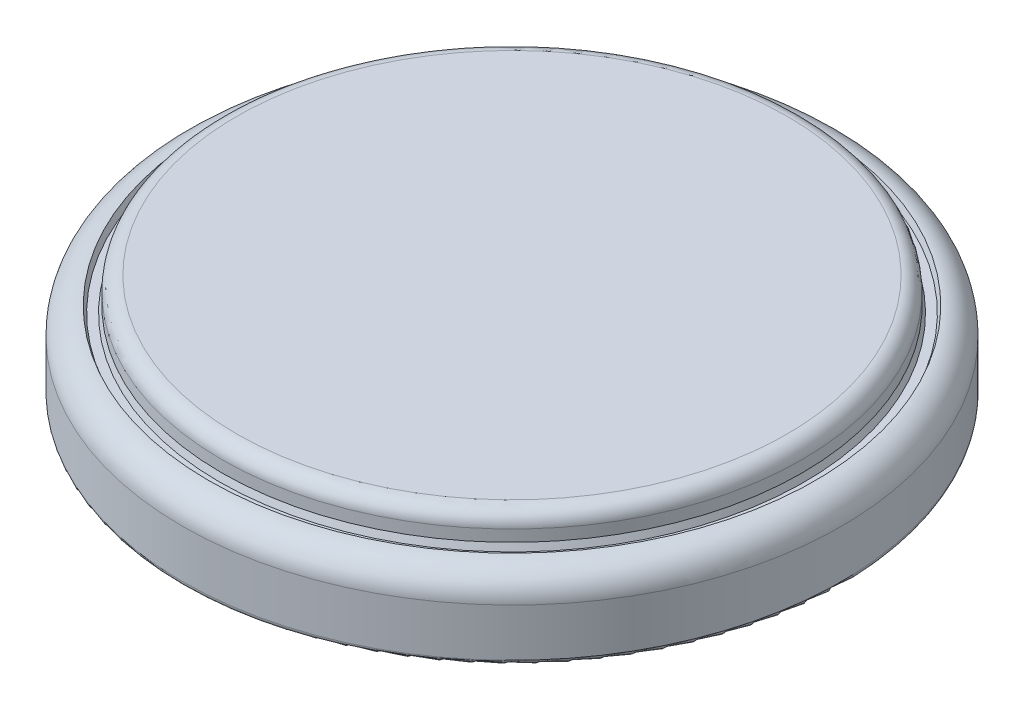
ISO-10303-21;
HEADER;
FILE_DESCRIPTION(('STEP AP214'),'2;1');
FILE_NAME('part.step','',(''),(''),'','','');
FILE_SCHEMA(('AUTOMOTIVE_DESIGN { 1 0 10303 214 1 1 1 1 }'));
ENDSEC;
DATA;
#1=APPLICATION_CONTEXT('core data for automotive mechanical design processes');
#2=APPLICATION_PROTOCOL_DEFINITION('international standard','automotive_design',2000,#1);
#3=PRODUCT_CONTEXT('',#1,'mechanical');
#4=PRODUCT('Part','Part','',(#3));
#5=PRODUCT_RELATED_PRODUCT_CATEGORY('part','',(#4));
#6=PRODUCT_DEFINITION_FORMATION('','',#4);
#7=PRODUCT_DEFINITION_CONTEXT('part definition',#1,'design');
#8=PRODUCT_DEFINITION('design','',#6,#7);
#9=PRODUCT_DEFINITION_SHAPE('','',#8);
#10=(LENGTH_UNIT() NAMED_UNIT(*) SI_UNIT(.MILLI.,.METRE.));
#11=(NAMED_UNIT(*) PLANE_ANGLE_UNIT() SI_UNIT($,.RADIAN.));
#12=(NAMED_UNIT(*) SI_UNIT($,.STERADIAN.) SOLID_ANGLE_UNIT());
#13=UNCERTAINTY_MEASURE_WITH_UNIT(LENGTH_MEASURE(1.E-05),#10,'distance_accuracy_value','');
#14=(GEOMETRIC_REPRESENTATION_CONTEXT(3) GLOBAL_UNCERTAINTY_ASSIGNED_CONTEXT((#13)) GLOBAL_UNIT_ASSIGNED_CONTEXT((#10,
#11,#12)) REPRESENTATION_CONTEXT('',''));
#15=CARTESIAN_POINT('',(0.,0.,0.));
#16=DIRECTION('',(0.,0.,1.));
#17=DIRECTION('',(1.,0.,0.));
#18=AXIS2_PLACEMENT_3D('',#15,#16,#17);
#19=CARTESIAN_POINT('',(0.,2.4,0.));
#20=DIRECTION('',(0.,-1.,0.));
#21=DIRECTION('',(0.,0.,-1.));
#22=AXIS2_PLACEMENT_3D('',#19,#20,#21);
#23=CYLINDRICAL_SURFACE('',#22,10.);
#24=CARTESIAN_POINT('',(0.,0.15,0.));
#25=DIRECTION('',(0.,1.,0.));
#26=DIRECTION('',(0.,0.,1.));
#27=AXIS2_PLACEMENT_3D('',#24,#25,#26);
#28=CIRCLE('',#27,10.);
#29=CARTESIAN_POINT('',(0.,0.15,10.));
#30=VERTEX_POINT('',#29);
#31=EDGE_CURVE('E44',#30,#30,#28,.T.);
#32=ORIENTED_EDGE('',*,*,#31,.T.);
#33=EDGE_LOOP('',(#32));
#34=FACE_BOUND('',#33,.T.);
#35=CARTESIAN_POINT('',(0.,1.6,0.));
#36=DIRECTION('',(0.,1.,0.));
#37=DIRECTION('',(0.,0.,1.));
#38=AXIS2_PLACEMENT_3D('',#35,#36,#37);
#39=CIRCLE('',#38,10.);
#40=CARTESIAN_POINT('',(0.,1.6,10.));
#41=VERTEX_POINT('',#40);
#42=EDGE_CURVE('E49',#41,#41,#39,.F.);
#43=ORIENTED_EDGE('',*,*,#42,.T.);
#44=EDGE_LOOP('',(#43));
#45=FACE_BOUND('',#44,.T.);
#46=ADVANCED_FACE('F29',(#34,#45),#23,.T.);
#47=CARTESIAN_POINT('',(0.,0.,0.));
#48=DIRECTION('',(0.,1.,0.));
#49=DIRECTION('',(0.,0.,1.));
#50=AXIS2_PLACEMENT_3D('',#47,#48,#49);
#51=PLANE('',#50);
#52=CARTESIAN_POINT('',(0.,0.,0.));
#53=DIRECTION('',(0.,1.,0.));
#54=DIRECTION('',(0.,0.,1.));
#55=AXIS2_PLACEMENT_3D('',#52,#53,#54);
#56=CIRCLE('',#55,9.85);
#57=CARTESIAN_POINT('',(0.,0.,9.85));
#58=VERTEX_POINT('',#57);
#59=EDGE_CURVE('E40',#58,#58,#56,.F.);
#60=ORIENTED_EDGE('',*,*,#59,.T.);
#61=EDGE_LOOP('',(#60));
#62=FACE_BOUND('',#61,.T.);
#63=ADVANCED_FACE('F83',(#62),#51,.F.);
#64=CARTESIAN_POINT('',(0.,1.6,0.));
#65=DIRECTION('',(0.,1.,0.));
#66=DIRECTION('',(0.,0.,1.));
#67=AXIS2_PLACEMENT_3D('',#64,#65,#66);
#68=TOROIDAL_SURFACE('',#67,9.2,0.8);
#69=ORIENTED_EDGE('',*,*,#42,.F.);
#70=EDGE_LOOP('',(#69));
#71=FACE_BOUND('',#70,.T.);
#72=CARTESIAN_POINT('',(0.,2.4,0.));
#73=DIRECTION('',(0.,1.,0.));
#74=DIRECTION('',(0.,0.,1.));
#75=AXIS2_PLACEMENT_3D('',#72,#73,#74);
#76=CIRCLE('',#75,9.2);
#77=CARTESIAN_POINT('',(0.,2.4,9.2));
#78=VERTEX_POINT('',#77);
#79=EDGE_CURVE('E55',#78,#78,#76,.T.);
#80=ORIENTED_EDGE('',*,*,#79,.F.);
#81=EDGE_LOOP('',(#80));
#82=FACE_BOUND('',#81,.T.);
#83=ADVANCED_FACE('F89',(#71,#82),#68,.T.);
#84=CARTESIAN_POINT('',(0.,0.15,0.));
#85=DIRECTION('',(0.,1.,0.));
#86=DIRECTION('',(0.,0.,1.));
#87=AXIS2_PLACEMENT_3D('',#84,#85,#86);
#88=TOROIDAL_SURFACE('',#87,9.85,0.15);
#89=ORIENTED_EDGE('',*,*,#59,.F.);
#90=EDGE_LOOP('',(#89));
#91=FACE_BOUND('',#90,.T.);
#92=ORIENTED_EDGE('',*,*,#31,.F.);
#93=EDGE_LOOP('',(#92));
#94=FACE_BOUND('',#93,.T.);
#95=ADVANCED_FACE('F96',(#91,#94),#88,.T.);
#96=CARTESIAN_POINT('',(0.,2.4,0.));
#97=DIRECTION('',(0.,1.,0.));
#98=DIRECTION('',(0.,0.,1.));
#99=AXIS2_PLACEMENT_3D('',#96,#97,#98);
#100=CONICAL_SURFACE('',#99,9.2,0.349065850398867);
#101=CARTESIAN_POINT('',(0.,2.2,0.));
#102=DIRECTION('',(0.,1.,0.));
#103=DIRECTION('',(0.,0.,1.));
#104=AXIS2_PLACEMENT_3D('',#101,#102,#103);
#105=CIRCLE('',#104,9.12720595314676);
#106=CARTESIAN_POINT('',(0.,2.2,9.12720595314676));
#107=VERTEX_POINT('',#106);
#108=EDGE_CURVE('E52',#107,#107,#105,.T.);
#109=ORIENTED_EDGE('',*,*,#108,.F.);
#110=EDGE_LOOP('',(#109));
#111=FACE_BOUND('',#110,.T.);
#112=ORIENTED_EDGE('',*,*,#79,.T.);
#113=EDGE_LOOP('',(#112));
#114=FACE_BOUND('',#113,.T.);
#115=ADVANCED_FACE('F78',(#111,#114),#100,.F.);
#116=CARTESIAN_POINT('',(0.,2.2,0.));
#117=DIRECTION('',(0.,1.,0.));
#118=DIRECTION('',(0.,0.,1.));
#119=AXIS2_PLACEMENT_3D('',#116,#117,#118);
#120=PLANE('',#119);
#121=CARTESIAN_POINT('',(0.,2.2,0.));
#122=DIRECTION('',(0.,1.,0.));
#123=DIRECTION('',(0.,0.,1.));
#124=AXIS2_PLACEMENT_3D('',#121,#122,#123);
#125=CIRCLE('',#124,8.87279404685324);
#126=CARTESIAN_POINT('',(0.,2.2,8.87279404685324));
#127=VERTEX_POINT('',#126);
#128=EDGE_CURVE('E56',#127,#127,#125,.T.);
#129=ORIENTED_EDGE('',*,*,#128,.F.);
#130=EDGE_LOOP('',(#129));
#131=FACE_BOUND('',#130,.T.);
#132=ORIENTED_EDGE('',*,*,#108,.T.);
#133=EDGE_LOOP('',(#132));
#134=FACE_BOUND('',#133,.T.);
#135=ADVANCED_FACE('F70',(#131,#134),#120,.T.);
#136=CARTESIAN_POINT('',(0.,2.4,0.));
#137=DIRECTION('',(0.,-1.,0.));
#138=DIRECTION('',(0.,0.,1.));
#139=AXIS2_PLACEMENT_3D('',#136,#137,#138);
#140=CONICAL_SURFACE('',#139,8.8,0.349065850398867);
#141=ORIENTED_EDGE('',*,*,#128,.T.);
#142=EDGE_LOOP('',(#141));
#143=FACE_BOUND('',#142,.T.);
#144=CARTESIAN_POINT('',(0.,2.4,0.));
#145=DIRECTION('',(0.,1.,0.));
#146=DIRECTION('',(0.,0.,1.));
#147=AXIS2_PLACEMENT_3D('',#144,#145,#146);
#148=CIRCLE('',#147,8.8);
#149=CARTESIAN_POINT('',(0.,2.4,8.8));
#150=VERTEX_POINT('',#149);
#151=EDGE_CURVE('E59',#150,#150,#148,.T.);
#152=ORIENTED_EDGE('',*,*,#151,.F.);
#153=EDGE_LOOP('',(#152));
#154=FACE_BOUND('',#153,.T.);
#155=ADVANCED_FACE('F67',(#143,#154),#140,.T.);
#156=CARTESIAN_POINT('',(0.,3.2,0.));
#157=DIRECTION('',(0.,1.,0.));
#158=DIRECTION('',(0.,0.,1.));
#159=AXIS2_PLACEMENT_3D('',#156,#157,#158);
#160=PLANE('',#159);
#161=CARTESIAN_POINT('',(0.,3.2,0.));
#162=DIRECTION('',(0.,1.,0.));
#163=DIRECTION('',(0.,0.,1.));
#164=AXIS2_PLACEMENT_3D('',#161,#162,#163);
#165=CIRCLE('',#164,8.35);
#166=CARTESIAN_POINT('',(0.,3.2,8.35));
#167=VERTEX_POINT('',#166);
#168=EDGE_CURVE('E36',#167,#167,#165,.T.);
#169=ORIENTED_EDGE('',*,*,#168,.T.);
#170=EDGE_LOOP('',(#169));
#171=FACE_BOUND('',#170,.T.);
#172=ADVANCED_FACE('F69',(#171),#160,.T.);
#173=CARTESIAN_POINT('',(0.,2.75,0.));
#174=DIRECTION('',(0.,1.,0.));
#175=DIRECTION('',(0.,0.,1.));
#176=AXIS2_PLACEMENT_3D('',#173,#174,#175);
#177=TOROIDAL_SURFACE('',#176,8.35,0.45);
#178=CARTESIAN_POINT('',(0.,2.75,0.));
#179=DIRECTION('',(0.,1.,0.));
#180=DIRECTION('',(0.,0.,1.));
#181=AXIS2_PLACEMENT_3D('',#178,#179,#180);
#182=CIRCLE('',#181,8.8);
#183=CARTESIAN_POINT('',(0.,2.75,8.8));
#184=VERTEX_POINT('',#183);
#185=EDGE_CURVE('E10',#184,#184,#182,.F.);
#186=ORIENTED_EDGE('',*,*,#185,.F.);
#187=EDGE_LOOP('',(#186));
#188=FACE_BOUND('',#187,.T.);
#189=ORIENTED_EDGE('',*,*,#168,.F.);
#190=EDGE_LOOP('',(#189));
#191=FACE_BOUND('',#190,.T.);
#192=ADVANCED_FACE('F31',(#188,#191),#177,.T.);
#193=CARTESIAN_POINT('',(0.,3.2,0.));
#194=DIRECTION('',(0.,-1.,0.));
#195=DIRECTION('',(0.,0.,-1.));
#196=AXIS2_PLACEMENT_3D('',#193,#194,#195);
#197=CYLINDRICAL_SURFACE('',#196,8.8);
#198=ORIENTED_EDGE('',*,*,#185,.T.);
#199=EDGE_LOOP('',(#198));
#200=FACE_BOUND('',#199,.T.);
#201=ORIENTED_EDGE('',*,*,#151,.T.);
#202=EDGE_LOOP('',(#201));
#203=FACE_BOUND('',#202,.T.);
#204=ADVANCED_FACE('F65',(#200,#203),#197,.T.);
#205=CLOSED_SHELL('',(#46,#63,#83,#95,#115,#135,#155,#172,#192,#204));
#206=MANIFOLD_SOLID_BREP('B2',#205);
#207=ADVANCED_BREP_SHAPE_REPRESENTATION('',(#18,#206),#14);
#208=SHAPE_DEFINITION_REPRESENTATION(#9,#207);
ENDSEC;
END-ISO-10303-21;
